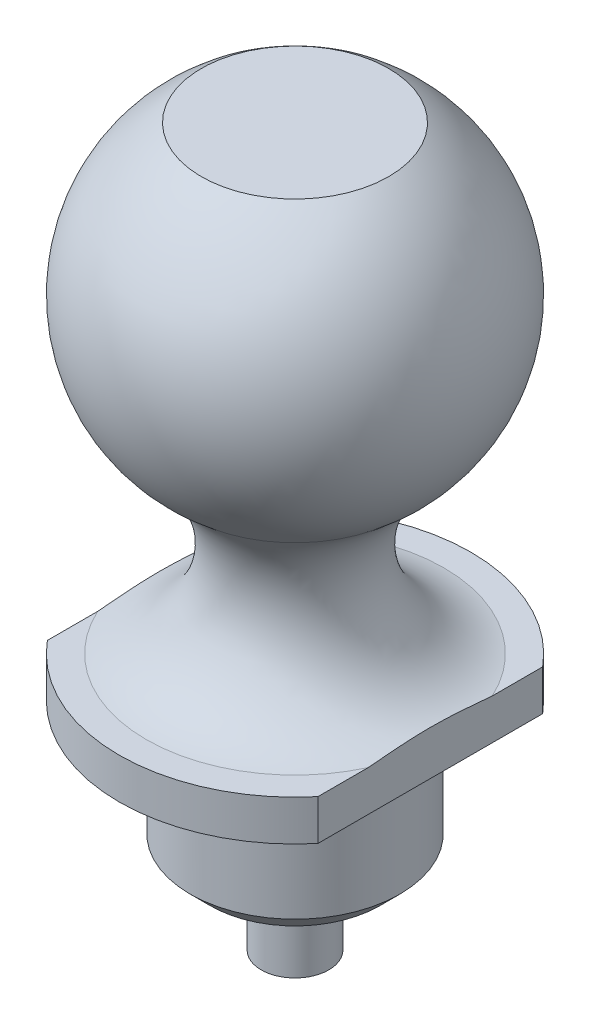
ISO-10303-21;
HEADER;
FILE_DESCRIPTION(('STEP AP214'),'2;1');
FILE_NAME('part.step','',(''),(''),'','','');
FILE_SCHEMA(('AUTOMOTIVE_DESIGN { 1 0 10303 214 1 1 1 1 }'));
ENDSEC;
DATA;
#1=APPLICATION_CONTEXT('core data for automotive mechanical design processes');
#2=APPLICATION_PROTOCOL_DEFINITION('international standard','automotive_design',2000,#1);
#3=PRODUCT_CONTEXT('',#1,'mechanical');
#4=PRODUCT('Part','Part','',(#3));
#5=PRODUCT_RELATED_PRODUCT_CATEGORY('part','',(#4));
#6=PRODUCT_DEFINITION_FORMATION('','',#4);
#7=PRODUCT_DEFINITION_CONTEXT('part definition',#1,'design');
#8=PRODUCT_DEFINITION('design','',#6,#7);
#9=PRODUCT_DEFINITION_SHAPE('','',#8);
#10=(LENGTH_UNIT() NAMED_UNIT(*) SI_UNIT(.MILLI.,.METRE.));
#11=(NAMED_UNIT(*) PLANE_ANGLE_UNIT() SI_UNIT($,.RADIAN.));
#12=(NAMED_UNIT(*) SI_UNIT($,.STERADIAN.) SOLID_ANGLE_UNIT());
#13=UNCERTAINTY_MEASURE_WITH_UNIT(LENGTH_MEASURE(1.E-05),#10,'distance_accuracy_value','');
#14=(GEOMETRIC_REPRESENTATION_CONTEXT(3) GLOBAL_UNCERTAINTY_ASSIGNED_CONTEXT((#13)) GLOBAL_UNIT_ASSIGNED_CONTEXT((#10,
#11,#12)) REPRESENTATION_CONTEXT('',''));
#15=CARTESIAN_POINT('',(0.,0.,0.));
#16=DIRECTION('',(0.,0.,1.));
#17=DIRECTION('',(1.,0.,0.));
#18=AXIS2_PLACEMENT_3D('',#15,#16,#17);
#19=CARTESIAN_POINT('',(0.,-13.,0.));
#20=DIRECTION('',(0.,-1.,0.));
#21=DIRECTION('',(1.,0.,0.));
#22=AXIS2_PLACEMENT_3D('',#19,#20,#21);
#23=CYLINDRICAL_SURFACE('',#22,6.5);
#24=DIRECTION('',(0.,-1.,0.));
#25=VECTOR('',#24,1.);
#26=CARTESIAN_POINT('',(-5.,-8.,4.15331193145904));
#27=LINE('',#26,#25);
#28=CARTESIAN_POINT('',(-5.,-11.5,4.15331193145904));
#29=VERTEX_POINT('',#28);
#30=CARTESIAN_POINT('',(-5.,-13.,4.15331193145904));
#31=VERTEX_POINT('',#30);
#32=EDGE_CURVE('E101',#29,#31,#27,.T.);
#33=ORIENTED_EDGE('',*,*,#32,.T.);
#34=CARTESIAN_POINT('',(0.,-13.,0.));
#35=DIRECTION('',(0.,-1.,0.));
#36=DIRECTION('',(1.,0.,0.));
#37=AXIS2_PLACEMENT_3D('',#34,#35,#36);
#38=CIRCLE('',#37,6.5);
#39=CARTESIAN_POINT('',(5.,-13.,4.15331193145904));
#40=VERTEX_POINT('',#39);
#41=EDGE_CURVE('E112',#40,#31,#38,.T.);
#42=ORIENTED_EDGE('',*,*,#41,.F.);
#43=DIRECTION('',(0.,-1.,0.));
#44=VECTOR('',#43,1.);
#45=CARTESIAN_POINT('',(5.,-8.,4.15331193145904));
#46=LINE('',#45,#44);
#47=CARTESIAN_POINT('',(5.,-11.5,4.15331193145904));
#48=VERTEX_POINT('',#47);
#49=EDGE_CURVE('E207',#48,#40,#46,.T.);
#50=ORIENTED_EDGE('',*,*,#49,.F.);
#51=CARTESIAN_POINT('',(0.,-11.5,0.));
#52=DIRECTION('',(0.,-1.,0.));
#53=DIRECTION('',(1.,0.,0.));
#54=AXIS2_PLACEMENT_3D('',#51,#52,#53);
#55=CIRCLE('',#54,6.5);
#56=EDGE_CURVE('E118',#48,#29,#55,.T.);
#57=ORIENTED_EDGE('',*,*,#56,.T.);
#58=EDGE_LOOP('',(#33,#42,#50,#57));
#59=FACE_BOUND('',#58,.T.);
#60=ADVANCED_FACE('F37',(#59),#23,.T.);
#61=CARTESIAN_POINT('',(5.5,-11.5,0.));
#62=DIRECTION('',(0.,1.,0.));
#63=DIRECTION('',(-1.,0.,0.));
#64=AXIS2_PLACEMENT_3D('',#61,#62,#63);
#65=PLANE('',#64);
#66=DIRECTION('',(0.,0.,-1.));
#67=VECTOR('',#66,1.);
#68=CARTESIAN_POINT('',(-5.,-11.5,0.));
#69=LINE('',#68,#67);
#70=CARTESIAN_POINT('',(-5.,-11.5,2.29128784747792));
#71=VERTEX_POINT('',#70);
#72=EDGE_CURVE('E54',#29,#71,#69,.T.);
#73=ORIENTED_EDGE('',*,*,#72,.F.);
#74=ORIENTED_EDGE('',*,*,#56,.F.);
#75=DIRECTION('',(0.,0.,1.));
#76=VECTOR('',#75,1.);
#77=CARTESIAN_POINT('',(5.,-11.5,0.));
#78=LINE('',#77,#76);
#79=CARTESIAN_POINT('',(5.,-11.5,2.29128784747792));
#80=VERTEX_POINT('',#79);
#81=EDGE_CURVE('E209',#80,#48,#78,.T.);
#82=ORIENTED_EDGE('',*,*,#81,.F.);
#83=CARTESIAN_POINT('',(0.,-11.5,0.));
#84=DIRECTION('',(0.,-1.,0.));
#85=DIRECTION('',(1.,0.,0.));
#86=AXIS2_PLACEMENT_3D('',#83,#84,#85);
#87=CIRCLE('',#86,5.5);
#88=EDGE_CURVE('E217',#80,#71,#87,.T.);
#89=ORIENTED_EDGE('',*,*,#88,.T.);
#90=EDGE_LOOP('',(#73,#74,#82,#89));
#91=FACE_BOUND('',#90,.T.);
#92=ADVANCED_FACE('F159',(#91),#65,.T.);
#93=CARTESIAN_POINT('',(0.,5.5,0.));
#94=DIRECTION('',(0.,1.,0.));
#95=DIRECTION('',(-1.,0.,0.));
#96=AXIS2_PLACEMENT_3D('',#93,#94,#95);
#97=PLANE('',#96);
#98=CARTESIAN_POINT('',(0.,5.5,0.));
#99=DIRECTION('',(0.,-1.,0.));
#100=DIRECTION('',(1.,0.,0.));
#101=AXIS2_PLACEMENT_3D('',#98,#99,#100);
#102=CIRCLE('',#101,3.46410161513776);
#103=CARTESIAN_POINT('',(3.46410161513776,5.5,0.));
#104=VERTEX_POINT('',#103);
#105=EDGE_CURVE('E213',#104,#104,#102,.T.);
#106=ORIENTED_EDGE('',*,*,#105,.F.);
#107=EDGE_LOOP('',(#106));
#108=FACE_BOUND('',#107,.T.);
#109=ADVANCED_FACE('F39',(#108),#97,.T.);
#110=CARTESIAN_POINT('',(4.30473862248624,-13.,0.));
#111=DIRECTION('',(0.,-1.,0.));
#112=DIRECTION('',(1.,0.,0.));
#113=AXIS2_PLACEMENT_3D('',#110,#111,#112);
#114=PLANE('',#113);
#115=CARTESIAN_POINT('',(-5.,-13.,-4.15331193145904));
#116=VERTEX_POINT('',#115);
#117=CARTESIAN_POINT('',(5.,-13.,-4.15331193145904));
#118=VERTEX_POINT('',#117);
#119=EDGE_CURVE('E109',#116,#118,#38,.T.);
#120=ORIENTED_EDGE('',*,*,#119,.T.);
#121=DIRECTION('',(0.,0.,-1.));
#122=VECTOR('',#121,1.);
#123=CARTESIAN_POINT('',(5.,-13.,-4.15331193145904));
#124=LINE('',#123,#122);
#125=EDGE_CURVE('E205',#40,#118,#124,.T.);
#126=ORIENTED_EDGE('',*,*,#125,.F.);
#127=ORIENTED_EDGE('',*,*,#41,.T.);
#128=DIRECTION('',(0.,0.,1.));
#129=VECTOR('',#128,1.);
#130=CARTESIAN_POINT('',(-5.,-13.,4.15331193145904));
#131=LINE('',#130,#129);
#132=EDGE_CURVE('E95',#116,#31,#131,.T.);
#133=ORIENTED_EDGE('',*,*,#132,.F.);
#134=EDGE_LOOP('',(#120,#126,#127,#133));
#135=FACE_BOUND('',#134,.T.);
#136=CARTESIAN_POINT('',(0.,-13.,0.));
#137=DIRECTION('',(0.,-1.,0.));
#138=DIRECTION('',(1.,0.,0.));
#139=AXIS2_PLACEMENT_3D('',#136,#137,#138);
#140=CIRCLE('',#139,3.875);
#141=CARTESIAN_POINT('',(3.875,-13.,0.));
#142=VERTEX_POINT('',#141);
#143=EDGE_CURVE('E196',#142,#142,#140,.F.);
#144=ORIENTED_EDGE('',*,*,#143,.T.);
#145=EDGE_LOOP('',(#144));
#146=FACE_BOUND('',#145,.T.);
#147=ADVANCED_FACE('F106',(#135,#146),#114,.T.);
#148=DIRECTION('',(0.,-1.,0.));
#149=VECTOR('',#148,1.);
#150=CARTESIAN_POINT('',(-5.,-8.,-4.15331193145904));
#151=LINE('',#150,#149);
#152=CARTESIAN_POINT('',(-5.,-11.5,-4.15331193145904));
#153=VERTEX_POINT('',#152);
#154=EDGE_CURVE('E92',#153,#116,#151,.T.);
#155=ORIENTED_EDGE('',*,*,#154,.F.);
#156=CARTESIAN_POINT('',(5.,-11.5,-4.15331193145904));
#157=VERTEX_POINT('',#156);
#158=EDGE_CURVE('E122',#153,#157,#55,.T.);
#159=ORIENTED_EDGE('',*,*,#158,.T.);
#160=DIRECTION('',(0.,-1.,0.));
#161=VECTOR('',#160,1.);
#162=CARTESIAN_POINT('',(5.,-8.,-4.15331193145904));
#163=LINE('',#162,#161);
#164=EDGE_CURVE('E117',#157,#118,#163,.T.);
#165=ORIENTED_EDGE('',*,*,#164,.T.);
#166=ORIENTED_EDGE('',*,*,#119,.F.);
#167=EDGE_LOOP('',(#155,#159,#165,#166));
#168=FACE_BOUND('',#167,.T.);
#169=ADVANCED_FACE('F115',(#168),#23,.T.);
#170=CARTESIAN_POINT('',(-5.,-11.5,-2.29128784747792));
#171=VERTEX_POINT('',#170);
#172=EDGE_CURVE('E97',#171,#153,#69,.T.);
#173=ORIENTED_EDGE('',*,*,#172,.F.);
#174=CARTESIAN_POINT('',(5.,-11.5,-2.29128784747792));
#175=VERTEX_POINT('',#174);
#176=EDGE_CURVE('E62',#171,#175,#87,.T.);
#177=ORIENTED_EDGE('',*,*,#176,.T.);
#178=EDGE_CURVE('E212',#157,#175,#78,.T.);
#179=ORIENTED_EDGE('',*,*,#178,.F.);
#180=ORIENTED_EDGE('',*,*,#158,.F.);
#181=EDGE_LOOP('',(#173,#177,#179,#180));
#182=FACE_BOUND('',#181,.T.);
#183=ADVANCED_FACE('F154',(#182),#65,.T.);
#184=CARTESIAN_POINT('',(0.,-7.97013374965638,0.));
#185=DIRECTION('',(0.,-1.,0.));
#186=DIRECTION('',(1.,0.,0.));
#187=AXIS2_PLACEMENT_3D('',#184,#185,#186);
#188=TOROIDAL_SURFACE('',#187,6.20221848638284,3.59903689171599);
#189=CARTESIAN_POINT('',(-5.,-11.3624393459923,0.));
#190=CARTESIAN_POINT('',(-5.,-11.3624391429958,-0.108000786727385));
#191=CARTESIAN_POINT('',(-5.,-11.3636871036064,-0.21600173638518));
#192=CARTESIAN_POINT('',(-5.,-11.3685868100359,-0.43194786977117));
#193=CARTESIAN_POINT('',(-5.,-11.3722385594991,-0.539893053414573));
#194=CARTESIAN_POINT('',(-5.,-11.3816837039588,-0.755712951704085));
#195=CARTESIAN_POINT('',(-5.,-11.3874776072516,-0.863587643532911));
#196=CARTESIAN_POINT('',(-5.,-11.4007930782753,-1.07923173941341));
#197=CARTESIAN_POINT('',(-5.,-11.4083146996472,-1.18700114009172));
#198=CARTESIAN_POINT('',(-5.,-11.4328068981453,-1.51151524702597));
#199=CARTESIAN_POINT('',(-5.,-11.4516335215005,-1.72811349293541));
#200=CARTESIAN_POINT('',(-5.,-11.4891834020882,-2.16130176881959));
#201=CARTESIAN_POINT('',(-5.,-11.5079066655364,-2.37789179849306));
#202=CARTESIAN_POINT('',(-5.,-11.539662203766,-2.80844293907149));
#203=CARTESIAN_POINT('',(-5.,-11.5527714515108,-3.02239775087409));
#204=CARTESIAN_POINT('',(-5.,-11.5687197103512,-3.45067057687575));
#205=CARTESIAN_POINT('',(-5.,-11.5715634815305,-3.6649883766213));
#206=CARTESIAN_POINT('',(-5.,-11.5623833885743,-4.09209359794306));
#207=CARTESIAN_POINT('',(-5.,-11.5504496447573,-4.30488241394577));
#208=CARTESIAN_POINT('',(-5.,-11.5076880394291,-4.7284923122439));
#209=CARTESIAN_POINT('',(-5.,-11.4768807496833,-4.9393152836128));
#210=CARTESIAN_POINT('',(-5.,-11.4102458796498,-5.26972628753738));
#211=CARTESIAN_POINT('',(-5.,-11.3818241581557,-5.39082220528498));
#212=CARTESIAN_POINT('',(-5.,-11.3166414177811,-5.63089122761205));
#213=CARTESIAN_POINT('',(-5.,-11.2798729884442,-5.74986234386577));
#214=CARTESIAN_POINT('',(-5.,-11.1973300471214,-5.98515016491875));
#215=CARTESIAN_POINT('',(-5.,-11.1515227800124,-6.10145544558495));
#216=CARTESIAN_POINT('',(-5.,-11.0505950969622,-6.32993816291247));
#217=CARTESIAN_POINT('',(-5.,-10.9954771210517,-6.44211667170936));
#218=CARTESIAN_POINT('',(-5.,-10.8750871101736,-6.66232345708793));
#219=CARTESIAN_POINT('',(-5.,-10.8097220374015,-6.77030110979233));
#220=CARTESIAN_POINT('',(-5.,-10.6691752149352,-6.97966516270776));
#221=CARTESIAN_POINT('',(-5.,-10.593995265721,-7.08105276672636));
#222=CARTESIAN_POINT('',(-5.,-10.4340771657797,-7.27577776802791));
#223=CARTESIAN_POINT('',(-5.,-10.3493523739873,-7.36912610175775));
#224=CARTESIAN_POINT('',(-5.,-10.1706763033755,-7.54653015811495));
#225=CARTESIAN_POINT('',(-5.,-10.0767271664288,-7.63058802837694));
#226=CARTESIAN_POINT('',(-5.,-9.8938043549029,-7.77720693630269));
#227=CARTESIAN_POINT('',(-5.,-9.80592412476048,-7.84113446465654));
#228=CARTESIAN_POINT('',(-5.,-9.62441718310582,-7.96021625229716));
#229=CARTESIAN_POINT('',(-5.,-9.53079158809108,-8.01537220872927));
#230=CARTESIAN_POINT('',(-5.,-9.33857594897611,-8.11611383195134));
#231=CARTESIAN_POINT('',(-5.,-9.23998873661072,-8.16170488259719));
#232=CARTESIAN_POINT('',(-5.,-9.0387472646961,-8.24267049641327));
#233=CARTESIAN_POINT('',(-5.,-8.93609359728096,-8.27804654086128));
#234=CARTESIAN_POINT('',(-5.,-8.65342621368126,-8.35937600301758));
#235=CARTESIAN_POINT('',(-5.,-8.47030175587491,-8.39496737072948));
#236=CARTESIAN_POINT('',(-5.,-8.10078974507977,-8.43278943783172));
#237=CARTESIAN_POINT('',(-5.,-7.91440390663604,-8.43503716833168));
#238=CARTESIAN_POINT('',(-5.,-7.55492361331038,-8.40700375387239));
#239=CARTESIAN_POINT('',(-5.,-7.38168152177811,-8.37858709092719));
#240=CARTESIAN_POINT('',(-5.,-7.0423711253434,-8.29333140644991));
#241=CARTESIAN_POINT('',(-5.,-6.87630273828681,-8.23649271050427));
#242=CARTESIAN_POINT('',(-5.,-6.55398241941081,-8.09598593677137));
#243=CARTESIAN_POINT('',(-5.,-6.39784680349988,-8.01205223380257));
#244=CARTESIAN_POINT('',(-5.,-6.10074692314794,-7.82075716735136));
#245=CARTESIAN_POINT('',(-5.,-5.9597831131092,-7.7133951024706));
#246=CARTESIAN_POINT('',(-5.,-5.68646900052745,-7.47097071927357));
#247=CARTESIAN_POINT('',(-5.,-5.55535280579342,-7.33452284438426));
#248=CARTESIAN_POINT('',(-5.,-5.31469404486364,-7.04364142355684));
#249=CARTESIAN_POINT('',(-5.,-5.20517366107617,-6.88918964104143));
#250=CARTESIAN_POINT('',(-5.,-5.03843299347164,-6.61638570342355));
#251=CARTESIAN_POINT('',(-5.,-4.97546954842118,-6.50147156032461));
#252=CARTESIAN_POINT('',(-5.,-4.85991600986661,-6.26649837135809));
#253=CARTESIAN_POINT('',(-5.,-4.80732912787158,-6.14643774662353));
#254=CARTESIAN_POINT('',(-5.,-4.71221837953451,-5.902526077833));
#255=CARTESIAN_POINT('',(-5.,-4.66968709200179,-5.77867790576608));
#256=CARTESIAN_POINT('',(-5.,-4.59406320582661,-5.52811750908777));
#257=CARTESIAN_POINT('',(-5.,-4.56097374596563,-5.40140434713009));
#258=CARTESIAN_POINT('',(-5.,-4.48762104510065,-5.07508011940292));
#259=CARTESIAN_POINT('',(-5.,-4.4535780922623,-4.87406299131931));
#260=CARTESIAN_POINT('',(-5.,-4.40362830656615,-4.46979852756669));
#261=CARTESIAN_POINT('',(-5.,-4.38773352262853,-4.26654980058245));
#262=CARTESIAN_POINT('',(-5.,-4.37049647525705,-3.85836200579484));
#263=CARTESIAN_POINT('',(-5.,-4.36923727565771,-3.65341988965373));
#264=CARTESIAN_POINT('',(-5.,-4.37752822004913,-3.24384311850896));
#265=CARTESIAN_POINT('',(-5.,-4.38707750395612,-3.03920844033838));
#266=CARTESIAN_POINT('',(-5.,-4.42022449256566,-2.51129922467263));
#267=CARTESIAN_POINT('',(-5.,-4.44876593329014,-2.18837796890309));
#268=CARTESIAN_POINT('',(-5.,-4.49071163533458,-1.70399206088977));
#269=CARTESIAN_POINT('',(-5.,-4.50454821640243,-1.54254037964888));
#270=CARTESIAN_POINT('',(-5.,-4.52983110743769,-1.21944454984037));
#271=CARTESIAN_POINT('',(-5.,-4.54127755348385,-1.05780041275719));
#272=CARTESIAN_POINT('',(-5.,-4.55997118516654,-0.734927301138958));
#273=CARTESIAN_POINT('',(-5.,-4.56723551081704,-0.573699367407277));
#274=CARTESIAN_POINT('',(-5.,-4.57648231380783,-0.251090676853258));
#275=CARTESIAN_POINT('',(-5.,-4.57846503057962,-0.0897099272903265));
#276=CARTESIAN_POINT('',(-5.,-4.57682747477897,0.233016539320673));
#277=CARTESIAN_POINT('',(-5.,-4.57320737349493,0.394362257288902));
#278=CARTESIAN_POINT('',(-5.,-4.56094856541285,0.716863036768059));
#279=CARTESIAN_POINT('',(-5.,-4.55230952781639,0.878018085010316));
#280=CARTESIAN_POINT('',(-5.,-4.5332678424916,1.17100555457212));
#281=CARTESIAN_POINT('',(-5.,-4.52346518684145,1.30287906530314));
#282=CARTESIAN_POINT('',(-5.,-4.50242365421878,1.56651271202467));
#283=CARTESIAN_POINT('',(-5.,-4.49118472132643,1.6982728433997));
#284=CARTESIAN_POINT('',(-5.,-4.45700580157737,2.09365976587269));
#285=CARTESIAN_POINT('',(-5.,-4.43361542123556,2.35724982323243));
#286=CARTESIAN_POINT('',(-5.,-4.39524444440393,2.88513194908777));
#287=CARTESIAN_POINT('',(-5.,-4.38026416659421,3.14942404380414));
#288=CARTESIAN_POINT('',(-5.,-4.3680098252893,3.67839920974821));
#289=CARTESIAN_POINT('',(-5.,-4.37071680845182,3.9430815586979));
#290=CARTESIAN_POINT('',(-5.,-4.39488766536465,4.34821212687288));
#291=CARTESIAN_POINT('',(-5.,-4.40704580682351,4.48920709552814));
#292=CARTESIAN_POINT('',(-5.,-4.43999011989459,4.7701682534312));
#293=CARTESIAN_POINT('',(-5.,-4.4607734901442,4.91013476170221));
#294=CARTESIAN_POINT('',(-5.,-4.51206696584998,5.18840433536153));
#295=CARTESIAN_POINT('',(-5.,-4.54258415622992,5.32670611271856));
#296=CARTESIAN_POINT('',(-5.,-4.61428841956481,5.60052246888564));
#297=CARTESIAN_POINT('',(-5.,-4.65547321847461,5.73603763508815));
#298=CARTESIAN_POINT('',(-5.,-4.74176232938579,5.981626529701));
#299=CARTESIAN_POINT('',(-5.,-4.78517719590302,6.09229330170808));
#300=CARTESIAN_POINT('',(-5.,-4.88041827550345,6.30993746621492));
#301=CARTESIAN_POINT('',(-5.,-4.93224267651412,6.4169156475182));
#302=CARTESIAN_POINT('',(-5.,-5.04448649650029,6.62615203060106));
#303=CARTESIAN_POINT('',(-5.,-5.10489717780333,6.72841489241856));
#304=CARTESIAN_POINT('',(-5.,-5.23438944135934,6.92725422228038));
#305=CARTESIAN_POINT('',(-5.,-5.303469604615,7.02383161711478));
#306=CARTESIAN_POINT('',(-5.,-5.49987834064438,7.2732236649927));
#307=CARTESIAN_POINT('',(-5.,-5.63505717919178,7.42001072379947));
#308=CARTESIAN_POINT('',(-5.,-5.92797681348676,7.68909387674476));
#309=CARTESIAN_POINT('',(-5.,-6.08571543478784,7.81139232851786));
#310=CARTESIAN_POINT('',(-5.,-6.42123109913284,8.02678673693565));
#311=CARTESIAN_POINT('',(-5.,-6.59910101324233,8.1197391774452));
#312=CARTESIAN_POINT('',(-5.,-6.96903691405744,8.2709836678598));
#313=CARTESIAN_POINT('',(-5.,-7.16109692561225,8.32929021395067));
#314=CARTESIAN_POINT('',(-5.,-7.53498573677379,8.40461017100463));
#315=CARTESIAN_POINT('',(-5.,-7.71616092632022,8.42489120848912));
#316=CARTESIAN_POINT('',(-5.,-8.07923471293315,8.43337881386844));
#317=CARTESIAN_POINT('',(-5.,-8.26113306840697,8.4215953200387));
#318=CARTESIAN_POINT('',(-5.,-8.61298282210378,8.3676056480725));
#319=CARTESIAN_POINT('',(-5.,-8.78312278635236,8.32661340363913));
#320=CARTESIAN_POINT('',(-5.,-9.11433064394356,8.2172640076519));
#321=CARTESIAN_POINT('',(-5.,-9.27539842607371,8.14890652072107));
#322=CARTESIAN_POINT('',(-5.,-9.58815465653271,7.98562476604201));
#323=CARTESIAN_POINT('',(-5.,-9.73954063696273,7.89012347965918));
#324=CARTESIAN_POINT('',(-5.,-10.0256254631844,7.67684486869521));
#325=CARTESIAN_POINT('',(-5.,-10.1603219166263,7.55906435661239));
#326=CARTESIAN_POINT('',(-5.,-10.4211227619605,7.2948989602172));
#327=CARTESIAN_POINT('',(-5.,-10.5456607904891,7.14697408713322));
#328=CARTESIAN_POINT('',(-5.,-10.7718709503885,6.83446321736534));
#329=CARTESIAN_POINT('',(-5.,-10.873519985546,6.66986063259737));
#330=CARTESIAN_POINT('',(-5.,-11.0286191751681,6.37666666024393));
#331=CARTESIAN_POINT('',(-5.,-11.087590035148,6.2509334482024));
#332=CARTESIAN_POINT('',(-5.,-11.194185076878,5.99466375554926));
#333=CARTESIAN_POINT('',(-5.,-11.241802324423,5.86412439548043));
#334=CARTESIAN_POINT('',(-5.,-11.3262023113958,5.59977379488552));
#335=CARTESIAN_POINT('',(-5.,-11.3629963646609,5.46596613048399));
#336=CARTESIAN_POINT('',(-5.,-11.4265886717096,5.19616305100631));
#337=CARTESIAN_POINT('',(-5.,-11.4533964416282,5.06016984817975));
#338=CARTESIAN_POINT('',(-5.,-11.5084988071041,4.7223135263479));
#339=CARTESIAN_POINT('',(-5.,-11.5315465780201,4.51959469427554));
#340=CARTESIAN_POINT('',(-5.,-11.5615066795494,4.11292140484343));
#341=CARTESIAN_POINT('',(-5.,-11.5684051667019,3.90896603752396));
#342=CARTESIAN_POINT('',(-5.,-11.5698183833786,3.50002979267176));
#343=CARTESIAN_POINT('',(-5.,-11.5642689034545,3.29504906484363));
#344=CARTESIAN_POINT('',(-5.,-11.5447876625725,2.885472034589));
#345=CARTESIAN_POINT('',(-5.,-11.5308528357613,2.6808759002365));
#346=CARTESIAN_POINT('',(-5.,-11.4988011451705,2.26963698913392));
#347=CARTESIAN_POINT('',(-5.,-11.4806373584834,2.06299820332875));
#348=CARTESIAN_POINT('',(-5.,-11.4448580801901,1.64966227040392));
#349=CARTESIAN_POINT('',(-5.,-11.4272426110425,1.44296512124274));
#350=CARTESIAN_POINT('',(-5.,-11.3970068558546,1.03037408141351));
#351=CARTESIAN_POINT('',(-5.,-11.3843581596823,0.824482495349043));
#352=CARTESIAN_POINT('',(-5.,-11.371374284968,0.515409659420006));
#353=CARTESIAN_POINT('',(-5.,-11.3680445524449,0.412355585759264));
#354=CARTESIAN_POINT('',(-5.,-11.3635772039157,0.206201056847266));
#355=CARTESIAN_POINT('',(-5.,-11.3624395397785,0.103100602664105));
#356=CARTESIAN_POINT('',(-5.,-11.3624393459923,0.));
#357=B_SPLINE_CURVE_WITH_KNOTS('',3,(#189,#190,#191,#192,#193,#194,#195,#196,#197,#198,#199,
#200,#201,#202,#203,#204,#205,#206,#207,#208,#209,#210,#211,#212,#213,#214,#215,#216,#217,#218,
#219,#220,#221,#222,#223,#224,#225,#226,#227,#228,#229,#230,#231,#232,#233,#234,#235,#236,#237,
#238,#239,#240,#241,#242,#243,#244,#245,#246,#247,#248,#249,#250,#251,#252,#253,#254,#255,#256,
#257,#258,#259,#260,#261,#262,#263,#264,#265,#266,#267,#268,#269,#270,#271,#272,#273,#274,#275,
#276,#277,#278,#279,#280,#281,#282,#283,#284,#285,#286,#287,#288,#289,#290,#291,#292,#293,#294,
#295,#296,#297,#298,#299,#300,#301,#302,#303,#304,#305,#306,#307,#308,#309,#310,#311,#312,#313,
#314,#315,#316,#317,#318,#319,#320,#321,#322,#323,#324,#325,#326,#327,#328,#329,#330,#331,#332,
#333,#334,#335,#336,#337,#338,#339,#340,#341,#342,#343,#344,#345,#346,#347,#348,#349,#350,#351,
#352,#353,#354,#355,#356),.UNSPECIFIED.,.T.,.F.,(4,2,2,2,2,2,2,2,2,2,2,2,2,2,2,2,2,2,2,2,2,2,2,
2,2,2,2,2,2,2,2,2,2,2,2,2,2,2,2,2,2,2,2,2,2,2,2,2,2,2,2,2,2,2,2,2,2,2,2,2,2,2,2,2,2,2,2,2,2,2,2,
2,2,2,2,2,2,2,2,2,2,2,2,4),(0.,0.323995821438758,0.647992134068174,0.972065374831538,
1.2961486785411,1.94837665705605,2.60056497631524,3.24350027561788,3.88613740862029,
4.52487466350847,5.1629169439451,5.5358245313342,5.90906450112181,6.28368272292471,
6.6582029214909,7.03634481588006,7.41441743963387,7.79196733814246,8.16942977678856,
8.4949668064777,8.8204407736286,9.14573104484013,9.47097412200267,10.0274587149915,
10.5836590595478,11.1078519750256,11.632038885789,12.16152919916,12.6910353665881,
13.2564825954146,13.82250763911,14.2151136675755,14.6078410162674,15.0002776147391,
15.3928445207655,16.003410283036,16.614381176435,17.2288179354041,17.8432058040789,
18.8156139623552,19.3017520517983,19.7878624561489,20.2719661353068,20.7560478681879,
21.240114802095,21.7242136445049,22.1209129707274,22.5176277466976,23.3114885244001,
24.105379381469,24.8984196593769,25.322753587452,25.7469498050869,26.171455488331,
26.5958707528329,26.9521814105696,27.308415392782,27.6642894215049,28.0201052775142,
28.6160232367488,29.2118837965154,29.8106148120489,30.4090951358636,30.9532543722595,
31.4972449678517,32.0198546034795,32.5424706441888,33.0771547003247,33.6119153119553,
34.1897565657288,34.7681783049913,35.1842671065095,35.6006093865254,36.0165148910464,
36.4320230506152,37.0432365504167,37.6549738020295,38.2698737859369,38.8849987264868,
39.5073047755929,40.1296362802021,40.7483542799675,41.0576566373048,41.3669522032279),.UNSPECIFIED.);
#358=EDGE_CURVE('E46',#71,#171,#357,.T.);
#359=ORIENTED_EDGE('',*,*,#358,.F.);
#360=ORIENTED_EDGE('',*,*,#88,.F.);
#361=CARTESIAN_POINT('',(5.,-11.3624393459923,0.));
#362=CARTESIAN_POINT('',(5.,-11.3624391429958,0.108000786727384));
#363=CARTESIAN_POINT('',(5.,-11.3636871036064,0.216001736385179));
#364=CARTESIAN_POINT('',(5.,-11.3685868100359,0.431947869771168));
#365=CARTESIAN_POINT('',(5.,-11.3722385594991,0.539893053414571));
#366=CARTESIAN_POINT('',(5.,-11.3816837039588,0.755712951704084));
#367=CARTESIAN_POINT('',(5.,-11.3874776072516,0.86358764353291));
#368=CARTESIAN_POINT('',(5.,-11.4007930782753,1.0792317394134));
#369=CARTESIAN_POINT('',(5.,-11.4083146996472,1.18700114009172));
#370=CARTESIAN_POINT('',(5.,-11.4328068981453,1.51151524702597));
#371=CARTESIAN_POINT('',(5.,-11.4516335215005,1.72811349293541));
#372=CARTESIAN_POINT('',(5.,-11.4891834020882,2.16130176881959));
#373=CARTESIAN_POINT('',(5.,-11.5079066655364,2.37789179849306));
#374=CARTESIAN_POINT('',(5.,-11.539662203766,2.80844293907149));
#375=CARTESIAN_POINT('',(5.,-11.5527714515108,3.02239775087409));
#376=CARTESIAN_POINT('',(5.,-11.5687197103512,3.45067057687575));
#377=CARTESIAN_POINT('',(5.,-11.5715634815305,3.66498837662129));
#378=CARTESIAN_POINT('',(5.,-11.5623833885743,4.09209359794306));
#379=CARTESIAN_POINT('',(5.,-11.5504496447573,4.30488241394577));
#380=CARTESIAN_POINT('',(5.,-11.5076880394291,4.7284923122439));
#381=CARTESIAN_POINT('',(5.,-11.4768807496833,4.9393152836128));
#382=CARTESIAN_POINT('',(5.,-11.4102458796498,5.26972628753738));
#383=CARTESIAN_POINT('',(5.,-11.3818241581557,5.39082220528498));
#384=CARTESIAN_POINT('',(5.,-11.3166414177811,5.63089122761205));
#385=CARTESIAN_POINT('',(5.,-11.2798729884442,5.74986234386577));
#386=CARTESIAN_POINT('',(5.,-11.1973300471214,5.98515016491875));
#387=CARTESIAN_POINT('',(5.,-11.1515227800124,6.10145544558495));
#388=CARTESIAN_POINT('',(5.,-11.0505950969622,6.32993816291247));
#389=CARTESIAN_POINT('',(5.,-10.9954771210517,6.44211667170936));
#390=CARTESIAN_POINT('',(5.,-10.8750871101736,6.66232345708793));
#391=CARTESIAN_POINT('',(5.,-10.8097220374015,6.77030110979233));
#392=CARTESIAN_POINT('',(5.,-10.6691752149352,6.97966516270776));
#393=CARTESIAN_POINT('',(5.,-10.593995265721,7.08105276672636));
#394=CARTESIAN_POINT('',(5.,-10.4340771657797,7.27577776802792));
#395=CARTESIAN_POINT('',(5.,-10.3493523739873,7.36912610175775));
#396=CARTESIAN_POINT('',(5.,-10.1706763033755,7.54653015811495));
#397=CARTESIAN_POINT('',(5.,-10.0767271664288,7.63058802837694));
#398=CARTESIAN_POINT('',(5.,-9.8938043549029,7.77720693630269));
#399=CARTESIAN_POINT('',(5.,-9.80592412476048,7.84113446465654));
#400=CARTESIAN_POINT('',(5.,-9.62441718310582,7.96021625229716));
#401=CARTESIAN_POINT('',(5.,-9.53079158809108,8.01537220872927));
#402=CARTESIAN_POINT('',(5.,-9.33857594897611,8.11611383195134));
#403=CARTESIAN_POINT('',(5.,-9.23998873661072,8.16170488259718));
#404=CARTESIAN_POINT('',(5.,-9.0387472646961,8.24267049641327));
#405=CARTESIAN_POINT('',(5.,-8.93609359728096,8.27804654086128));
#406=CARTESIAN_POINT('',(5.,-8.65342621368126,8.35937600301758));
#407=CARTESIAN_POINT('',(5.,-8.47030175587491,8.39496737072947));
#408=CARTESIAN_POINT('',(5.,-8.10078974507976,8.43278943783172));
#409=CARTESIAN_POINT('',(5.,-7.91440390663604,8.43503716833167));
#410=CARTESIAN_POINT('',(5.,-7.55492361331038,8.40700375387239));
#411=CARTESIAN_POINT('',(5.,-7.38168152177811,8.37858709092719));
#412=CARTESIAN_POINT('',(5.,-7.0423711253434,8.29333140644991));
#413=CARTESIAN_POINT('',(5.,-6.8763027382868,8.23649271050427));
#414=CARTESIAN_POINT('',(5.,-6.55398241941081,8.09598593677137));
#415=CARTESIAN_POINT('',(5.,-6.39784680349988,8.01205223380257));
#416=CARTESIAN_POINT('',(5.,-6.10074692314794,7.82075716735135));
#417=CARTESIAN_POINT('',(5.,-5.9597831131092,7.7133951024706));
#418=CARTESIAN_POINT('',(5.,-5.68646900052745,7.47097071927357));
#419=CARTESIAN_POINT('',(5.,-5.55535280579342,7.33452284438426));
#420=CARTESIAN_POINT('',(5.,-5.31469404486364,7.04364142355684));
#421=CARTESIAN_POINT('',(5.,-5.20517366107617,6.88918964104142));
#422=CARTESIAN_POINT('',(5.,-5.03843299347165,6.61638570342355));
#423=CARTESIAN_POINT('',(5.,-4.97546954842119,6.50147156032461));
#424=CARTESIAN_POINT('',(5.,-4.85991600986662,6.26649837135809));
#425=CARTESIAN_POINT('',(5.,-4.80732912787158,6.14643774662353));
#426=CARTESIAN_POINT('',(5.,-4.71221837953451,5.90252607783299));
#427=CARTESIAN_POINT('',(5.,-4.66968709200179,5.77867790576608));
#428=CARTESIAN_POINT('',(5.,-4.59406320582661,5.52811750908776));
#429=CARTESIAN_POINT('',(5.,-4.56097374596563,5.40140434713008));
#430=CARTESIAN_POINT('',(5.,-4.48762104510065,5.07508011940291));
#431=CARTESIAN_POINT('',(5.,-4.4535780922623,4.87406299131931));
#432=CARTESIAN_POINT('',(5.,-4.40362830656615,4.46979852756668));
#433=CARTESIAN_POINT('',(5.,-4.38773352262853,4.26654980058244));
#434=CARTESIAN_POINT('',(5.,-4.37049647525705,3.85836200579484));
#435=CARTESIAN_POINT('',(5.,-4.36923727565771,3.65341988965373));
#436=CARTESIAN_POINT('',(5.,-4.37752822004913,3.24384311850895));
#437=CARTESIAN_POINT('',(5.,-4.38707750395612,3.03920844033837));
#438=CARTESIAN_POINT('',(5.,-4.42022449256566,2.51129922467262));
#439=CARTESIAN_POINT('',(5.,-4.44876593329014,2.18837796890309));
#440=CARTESIAN_POINT('',(5.,-4.49071163533458,1.70399206088977));
#441=CARTESIAN_POINT('',(5.,-4.50454821640243,1.54254037964888));
#442=CARTESIAN_POINT('',(5.,-4.52983110743769,1.21944454984038));
#443=CARTESIAN_POINT('',(5.,-4.54127755348385,1.0578004127572));
#444=CARTESIAN_POINT('',(5.,-4.55997118516654,0.73492730113897));
#445=CARTESIAN_POINT('',(5.,-4.56723551081704,0.573699367407289));
#446=CARTESIAN_POINT('',(5.,-4.57648231380783,0.251090676853273));
#447=CARTESIAN_POINT('',(5.,-4.57846503057962,0.0897099272903428));
#448=CARTESIAN_POINT('',(5.,-4.57682747477897,-0.233016539320654));
#449=CARTESIAN_POINT('',(5.,-4.57320737349493,-0.394362257288882));
#450=CARTESIAN_POINT('',(5.,-4.56094856541285,-0.716863036768036));
#451=CARTESIAN_POINT('',(5.,-4.55230952781639,-0.87801808501029));
#452=CARTESIAN_POINT('',(5.,-4.53326784249161,-1.17100555457209));
#453=CARTESIAN_POINT('',(5.,-4.52346518684146,-1.3028790653031));
#454=CARTESIAN_POINT('',(5.,-4.50242365421879,-1.56651271202462));
#455=CARTESIAN_POINT('',(5.,-4.49118472132644,-1.69827284339964));
#456=CARTESIAN_POINT('',(5.,-4.45700580157738,-2.09365976587261));
#457=CARTESIAN_POINT('',(5.,-4.43361542123557,-2.35724982323234));
#458=CARTESIAN_POINT('',(5.,-4.39524444440394,-2.88513194908766));
#459=CARTESIAN_POINT('',(5.,-4.38026416659421,-3.14942404380402));
#460=CARTESIAN_POINT('',(5.,-4.3680098252893,-3.67839920974806));
#461=CARTESIAN_POINT('',(5.,-4.37071680845181,-3.94308155869774));
#462=CARTESIAN_POINT('',(5.,-4.39488766536464,-4.34821212687271));
#463=CARTESIAN_POINT('',(5.,-4.4070458068235,-4.48920709552799));
#464=CARTESIAN_POINT('',(5.,-4.43999011989457,-4.77016825343106));
#465=CARTESIAN_POINT('',(5.,-4.46077349014418,-4.91013476170208));
#466=CARTESIAN_POINT('',(5.,-4.51206696584996,-5.18840433536142));
#467=CARTESIAN_POINT('',(5.,-4.54258415622989,-5.32670611271844));
#468=CARTESIAN_POINT('',(5.,-4.61428841956478,-5.60052246888554));
#469=CARTESIAN_POINT('',(5.,-4.65547321847458,-5.73603763508807));
#470=CARTESIAN_POINT('',(5.,-4.74176232938576,-5.98162652970093));
#471=CARTESIAN_POINT('',(5.,-4.78517719590299,-6.09229330170801));
#472=CARTESIAN_POINT('',(5.,-4.88041827550342,-6.30993746621485));
#473=CARTESIAN_POINT('',(5.,-4.93224267651409,-6.41691564751813));
#474=CARTESIAN_POINT('',(5.,-5.04448649650025,-6.62615203060099));
#475=CARTESIAN_POINT('',(5.,-5.10489717780329,-6.7284148924185));
#476=CARTESIAN_POINT('',(5.,-5.2343894413593,-6.92725422228032));
#477=CARTESIAN_POINT('',(5.,-5.30346960461496,-7.02383161711473));
#478=CARTESIAN_POINT('',(5.,-5.49987834064433,-7.27322366499265));
#479=CARTESIAN_POINT('',(5.,-5.63505717919173,-7.42001072379942));
#480=CARTESIAN_POINT('',(5.,-5.92797681348671,-7.68909387674472));
#481=CARTESIAN_POINT('',(5.,-6.08571543478779,-7.81139232851783));
#482=CARTESIAN_POINT('',(5.,-6.42123109913279,-8.02678673693561));
#483=CARTESIAN_POINT('',(5.,-6.59910101324227,-8.11973917744517));
#484=CARTESIAN_POINT('',(5.,-6.96903691405738,-8.27098366785978));
#485=CARTESIAN_POINT('',(5.,-7.1610969256122,-8.32929021395065));
#486=CARTESIAN_POINT('',(5.,-7.53498573677374,-8.40461017100463));
#487=CARTESIAN_POINT('',(5.,-7.71616092632016,-8.42489120848911));
#488=CARTESIAN_POINT('',(5.,-8.0792347129331,-8.43337881386844));
#489=CARTESIAN_POINT('',(5.,-8.26113306840692,-8.42159532003871));
#490=CARTESIAN_POINT('',(5.,-8.61298282210373,-8.36760564807252));
#491=CARTESIAN_POINT('',(5.,-8.78312278635231,-8.32661340363915));
#492=CARTESIAN_POINT('',(5.,-9.11433064394351,-8.21726400765192));
#493=CARTESIAN_POINT('',(5.,-9.27539842607366,-8.14890652072109));
#494=CARTESIAN_POINT('',(5.,-9.58815465653267,-7.98562476604203));
#495=CARTESIAN_POINT('',(5.,-9.73954063696269,-7.89012347965921));
#496=CARTESIAN_POINT('',(5.,-10.0256254631843,-7.67684486869524));
#497=CARTESIAN_POINT('',(5.,-10.1603219166263,-7.55906435661243));
#498=CARTESIAN_POINT('',(5.,-10.4211227619604,-7.29489896021724));
#499=CARTESIAN_POINT('',(5.,-10.5456607904891,-7.14697408713327));
#500=CARTESIAN_POINT('',(5.,-10.7718709503885,-6.83446321736539));
#501=CARTESIAN_POINT('',(5.,-10.8735199855459,-6.66986063259742));
#502=CARTESIAN_POINT('',(5.,-11.028619175168,-6.37666666024399));
#503=CARTESIAN_POINT('',(5.,-11.087590035148,-6.25093344820245));
#504=CARTESIAN_POINT('',(5.,-11.194185076878,-5.99466375554932));
#505=CARTESIAN_POINT('',(5.,-11.241802324423,-5.8641243954805));
#506=CARTESIAN_POINT('',(5.,-11.3262023113957,-5.5997737948856));
#507=CARTESIAN_POINT('',(5.,-11.3629963646609,-5.46596613048406));
#508=CARTESIAN_POINT('',(5.,-11.4265886717096,-5.19616305100639));
#509=CARTESIAN_POINT('',(5.,-11.4533964416282,-5.06016984817983));
#510=CARTESIAN_POINT('',(5.,-11.5084988071041,-4.72231352634797));
#511=CARTESIAN_POINT('',(5.,-11.5315465780201,-4.51959469427562));
#512=CARTESIAN_POINT('',(5.,-11.5615066795494,-4.1129214048435));
#513=CARTESIAN_POINT('',(5.,-11.5684051667019,-3.90896603752403));
#514=CARTESIAN_POINT('',(5.,-11.5698183833786,-3.50002979267181));
#515=CARTESIAN_POINT('',(5.,-11.5642689034545,-3.29504906484368));
#516=CARTESIAN_POINT('',(5.,-11.5447876625725,-2.88547203458904));
#517=CARTESIAN_POINT('',(5.,-11.5308528357613,-2.68087590023655));
#518=CARTESIAN_POINT('',(5.,-11.4988011451705,-2.26963698913396));
#519=CARTESIAN_POINT('',(5.,-11.4806373584834,-2.06299820332878));
#520=CARTESIAN_POINT('',(5.,-11.4448580801901,-1.64966227040395));
#521=CARTESIAN_POINT('',(5.,-11.4272426110425,-1.44296512124277));
#522=CARTESIAN_POINT('',(5.,-11.3970068558546,-1.03037408141353));
#523=CARTESIAN_POINT('',(5.,-11.3843581596823,-0.824482495349058));
#524=CARTESIAN_POINT('',(5.,-11.371374284968,-0.515409659420014));
#525=CARTESIAN_POINT('',(5.,-11.3680445524449,-0.412355585759272));
#526=CARTESIAN_POINT('',(5.,-11.3635772039157,-0.206201056847272));
#527=CARTESIAN_POINT('',(5.,-11.3624395397785,-0.103100602664109));
#528=CARTESIAN_POINT('',(5.,-11.3624393459923,0.));
#529=B_SPLINE_CURVE_WITH_KNOTS('',3,(#361,#362,#363,#364,#365,#366,#367,#368,#369,#370,#371,
#372,#373,#374,#375,#376,#377,#378,#379,#380,#381,#382,#383,#384,#385,#386,#387,#388,#389,#390,
#391,#392,#393,#394,#395,#396,#397,#398,#399,#400,#401,#402,#403,#404,#405,#406,#407,#408,#409,
#410,#411,#412,#413,#414,#415,#416,#417,#418,#419,#420,#421,#422,#423,#424,#425,#426,#427,#428,
#429,#430,#431,#432,#433,#434,#435,#436,#437,#438,#439,#440,#441,#442,#443,#444,#445,#446,#447,
#448,#449,#450,#451,#452,#453,#454,#455,#456,#457,#458,#459,#460,#461,#462,#463,#464,#465,#466,
#467,#468,#469,#470,#471,#472,#473,#474,#475,#476,#477,#478,#479,#480,#481,#482,#483,#484,#485,
#486,#487,#488,#489,#490,#491,#492,#493,#494,#495,#496,#497,#498,#499,#500,#501,#502,#503,#504,
#505,#506,#507,#508,#509,#510,#511,#512,#513,#514,#515,#516,#517,#518,#519,#520,#521,#522,#523,
#524,#525,#526,#527,#528),.UNSPECIFIED.,.T.,.F.,(4,2,2,2,2,2,2,2,2,2,2,2,2,2,2,2,2,2,2,2,2,2,2,
2,2,2,2,2,2,2,2,2,2,2,2,2,2,2,2,2,2,2,2,2,2,2,2,2,2,2,2,2,2,2,2,2,2,2,2,2,2,2,2,2,2,2,2,2,2,2,2,
2,2,2,2,2,2,2,2,2,2,2,2,4),(0.,0.323995821438758,0.647992134068174,0.972065374831539,
1.29614867854111,1.94837665705605,2.60056497631524,3.24350027561788,3.88613740862029,
4.52487466350847,5.1629169439451,5.5358245313342,5.90906450112181,6.28368272292471,
6.65820292149091,7.03634481588007,7.41441743963388,7.79196733814247,8.16942977678857,
8.4949668064777,8.8204407736286,9.14573104484013,9.47097412200268,10.0274587149916,
10.5836590595478,11.1078519750256,11.632038885789,12.16152919916,12.6910353665881,
13.2564825954146,13.82250763911,14.2151136675755,14.6078410162674,15.0002776147392,
15.3928445207656,16.003410283036,16.614381176435,17.2288179354041,17.8432058040789,
18.8156139623552,19.3017520517983,19.7878624561489,20.2719661353068,20.7560478681879,
21.240114802095,21.7242136445049,22.1209129707274,22.5176277466976,23.3114885244,
24.1053793814689,24.8984196593768,25.3227535874519,25.7469498050868,26.1714554883309,
26.5958707528329,26.9521814105695,27.3084153927819,27.6642894215048,28.0201052775142,
28.6160232367488,29.2118837965153,29.8106148120488,30.4090951358635,30.9532543722595,
31.4972449678517,32.0198546034795,32.5424706441887,33.0771547003246,33.6119153119553,
34.1897565657287,34.7681783049912,35.1842671065095,35.6006093865254,36.0165148910463,
36.4320230506152,37.0432365504166,37.6549738020295,38.2698737859369,38.8849987264868,
39.5073047755928,40.1296362802021,40.7483542799675,41.0576566373048,41.366952203228),.UNSPECIFIED.);
#530=EDGE_CURVE('E128',#175,#80,#529,.T.);
#531=ORIENTED_EDGE('',*,*,#530,.F.);
#532=ORIENTED_EDGE('',*,*,#176,.F.);
#533=EDGE_LOOP('',(#359,#360,#531,#532));
#534=FACE_BOUND('',#533,.T.);
#535=CARTESIAN_POINT('',(0.,-5.12978315934875,0.));
#536=DIRECTION('',(0.,-1.,0.));
#537=DIRECTION('',(1.,0.,0.));
#538=AXIS2_PLACEMENT_3D('',#535,#536,#537);
#539=CIRCLE('',#538,3.99190740599803);
#540=CARTESIAN_POINT('',(3.99190740599803,-5.12978315934875,0.));
#541=VERTEX_POINT('',#540);
#542=EDGE_CURVE('E215',#541,#541,#539,.T.);
#543=ORIENTED_EDGE('',*,*,#542,.T.);
#544=EDGE_LOOP('',(#543));
#545=FACE_BOUND('',#544,.T.);
#546=ADVANCED_FACE('F138',(#534,#545),#188,.F.);
#547=CARTESIAN_POINT('',(0.,0.,0.));
#548=DIRECTION('',(0.,-1.,0.));
#549=DIRECTION('',(1.,0.,0.));
#550=AXIS2_PLACEMENT_3D('',#547,#548,#549);
#551=SPHERICAL_SURFACE('',#550,6.5);
#552=ORIENTED_EDGE('',*,*,#105,.T.);
#553=EDGE_LOOP('',(#552));
#554=FACE_BOUND('',#553,.T.);
#555=ORIENTED_EDGE('',*,*,#542,.F.);
#556=EDGE_LOOP('',(#555));
#557=FACE_BOUND('',#556,.T.);
#558=ADVANCED_FACE('F145',(#554,#557),#551,.T.);
#559=CARTESIAN_POINT('',(5.,-8.,-4.15331193145904));
#560=DIRECTION('',(-1.,0.,0.));
#561=DIRECTION('',(0.,-1.,0.));
#562=AXIS2_PLACEMENT_3D('',#559,#560,#561);
#563=PLANE('',#562);
#564=ORIENTED_EDGE('',*,*,#178,.T.);
#565=ORIENTED_EDGE('',*,*,#530,.T.);
#566=ORIENTED_EDGE('',*,*,#81,.T.);
#567=ORIENTED_EDGE('',*,*,#49,.T.);
#568=ORIENTED_EDGE('',*,*,#125,.T.);
#569=ORIENTED_EDGE('',*,*,#164,.F.);
#570=EDGE_LOOP('',(#564,#565,#566,#567,#568,#569));
#571=FACE_BOUND('',#570,.T.);
#572=ADVANCED_FACE('F142',(#571),#563,.F.);
#573=CARTESIAN_POINT('',(-5.,-8.,4.15331193145904));
#574=DIRECTION('',(1.,0.,0.));
#575=DIRECTION('',(0.,0.,-1.));
#576=AXIS2_PLACEMENT_3D('',#573,#574,#575);
#577=PLANE('',#576);
#578=ORIENTED_EDGE('',*,*,#72,.T.);
#579=ORIENTED_EDGE('',*,*,#358,.T.);
#580=ORIENTED_EDGE('',*,*,#172,.T.);
#581=ORIENTED_EDGE('',*,*,#154,.T.);
#582=ORIENTED_EDGE('',*,*,#132,.T.);
#583=ORIENTED_EDGE('',*,*,#32,.F.);
#584=EDGE_LOOP('',(#578,#579,#580,#581,#582,#583));
#585=FACE_BOUND('',#584,.T.);
#586=ADVANCED_FACE('F94',(#585),#577,.F.);
#587=CARTESIAN_POINT('',(0.,1.14213562373096,0.));
#588=DIRECTION('',(0.,-1.,0.));
#589=DIRECTION('',(1.,0.,0.));
#590=AXIS2_PLACEMENT_3D('',#587,#588,#589);
#591=CYLINDRICAL_SURFACE('',#590,3.875);
#592=CARTESIAN_POINT('',(0.,-17.2625953855672,0.));
#593=DIRECTION('',(0.,1.,0.));
#594=DIRECTION('',(-1.,0.,0.));
#595=AXIS2_PLACEMENT_3D('',#592,#593,#594);
#596=CIRCLE('',#595,3.875);
#597=CARTESIAN_POINT('',(-3.875,-17.2625953855672,0.));
#598=VERTEX_POINT('',#597);
#599=EDGE_CURVE('E41',#598,#598,#596,.F.);
#600=ORIENTED_EDGE('',*,*,#599,.F.);
#601=EDGE_LOOP('',(#600));
#602=FACE_BOUND('',#601,.T.);
#603=ORIENTED_EDGE('',*,*,#143,.F.);
#604=EDGE_LOOP('',(#603));
#605=FACE_BOUND('',#604,.T.);
#606=ADVANCED_FACE('F228',(#602,#605),#591,.T.);
#607=CARTESIAN_POINT('',(0.,-21.,0.));
#608=DIRECTION('',(0.,-1.,0.));
#609=DIRECTION('',(1.,0.,0.));
#610=AXIS2_PLACEMENT_3D('',#607,#608,#609);
#611=PLANE('',#610);
#612=CARTESIAN_POINT('',(0.,-21.,0.));
#613=DIRECTION('',(0.,-1.,0.));
#614=DIRECTION('',(1.,0.,0.));
#615=AXIS2_PLACEMENT_3D('',#612,#613,#614);
#616=CIRCLE('',#615,1.25);
#617=CARTESIAN_POINT('',(1.25,-21.,0.));
#618=VERTEX_POINT('',#617);
#619=EDGE_CURVE('E113',#618,#618,#616,.T.);
#620=ORIENTED_EDGE('',*,*,#619,.T.);
#621=EDGE_LOOP('',(#620));
#622=FACE_BOUND('',#621,.T.);
#623=ADVANCED_FACE('F187',(#622),#611,.T.);
#624=CARTESIAN_POINT('',(0.,-21.,0.));
#625=DIRECTION('',(0.,1.,0.));
#626=DIRECTION('',(-1.,0.,0.));
#627=AXIS2_PLACEMENT_3D('',#624,#625,#626);
#628=CYLINDRICAL_SURFACE('',#627,1.25);
#629=ORIENTED_EDGE('',*,*,#619,.F.);
#630=EDGE_LOOP('',(#629));
#631=FACE_BOUND('',#630,.T.);
#632=CARTESIAN_POINT('',(0.,-18.,0.));
#633=DIRECTION('',(0.,-1.,0.));
#634=DIRECTION('',(1.,0.,0.));
#635=AXIS2_PLACEMENT_3D('',#632,#633,#634);
#636=CIRCLE('',#635,1.25);
#637=CARTESIAN_POINT('',(1.25,-18.,0.));
#638=VERTEX_POINT('',#637);
#639=EDGE_CURVE('E11',#638,#638,#636,.T.);
#640=ORIENTED_EDGE('',*,*,#639,.T.);
#641=EDGE_LOOP('',(#640));
#642=FACE_BOUND('',#641,.T.);
#643=ADVANCED_FACE('F182',(#631,#642),#628,.T.);
#644=CARTESIAN_POINT('',(3.13759538556724,-18.,0.));
#645=DIRECTION('',(0.,-1.,0.));
#646=DIRECTION('',(1.,0.,0.));
#647=AXIS2_PLACEMENT_3D('',#644,#645,#646);
#648=PLANE('',#647);
#649=ORIENTED_EDGE('',*,*,#639,.F.);
#650=EDGE_LOOP('',(#649));
#651=FACE_BOUND('',#650,.T.);
#652=CARTESIAN_POINT('',(0.,-18.,0.));
#653=DIRECTION('',(0.,-1.,0.));
#654=DIRECTION('',(1.,0.,0.));
#655=AXIS2_PLACEMENT_3D('',#652,#653,#654);
#656=CIRCLE('',#655,3.13759538556724);
#657=CARTESIAN_POINT('',(3.13759538556724,-18.,0.));
#658=VERTEX_POINT('',#657);
#659=EDGE_CURVE('E120',#658,#658,#656,.T.);
#660=ORIENTED_EDGE('',*,*,#659,.T.);
#661=EDGE_LOOP('',(#660));
#662=FACE_BOUND('',#661,.T.);
#663=ADVANCED_FACE('F179',(#651,#662),#648,.T.);
#664=CARTESIAN_POINT('',(0.,-18.,0.));
#665=DIRECTION('',(0.,1.,0.));
#666=DIRECTION('',(-1.,0.,0.));
#667=AXIS2_PLACEMENT_3D('',#664,#665,#666);
#668=CONICAL_SURFACE('',#667,3.13759538556724,0.785398163397446);
#669=ORIENTED_EDGE('',*,*,#659,.F.);
#670=EDGE_LOOP('',(#669));
#671=FACE_BOUND('',#670,.T.);
#672=ORIENTED_EDGE('',*,*,#599,.T.);
#673=EDGE_LOOP('',(#672));
#674=FACE_BOUND('',#673,.T.);
#675=ADVANCED_FACE('F177',(#671,#674),#668,.T.);
#676=CLOSED_SHELL('',(#60,#92,#109,#147,#169,#183,#546,#558,#572,#586,#606,#623,#643,#663,#675));
#677=MANIFOLD_SOLID_BREP('B2',#676);
#678=ADVANCED_BREP_SHAPE_REPRESENTATION('',(#18,#677),#14);
#679=SHAPE_DEFINITION_REPRESENTATION(#9,#678);
ENDSEC;
END-ISO-10303-21;
